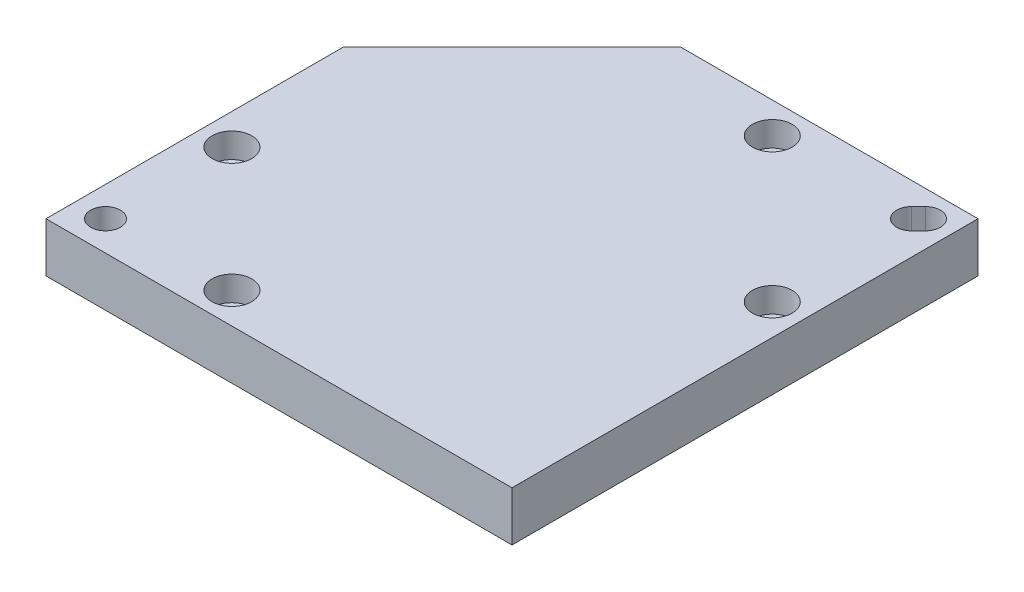
ISO-10303-21;
HEADER;
FILE_DESCRIPTION(('STEP AP214'),'2;1');
FILE_NAME('part.step','',(''),(''),'','','');
FILE_SCHEMA(('AUTOMOTIVE_DESIGN { 1 0 10303 214 1 1 1 1 }'));
ENDSEC;
DATA;
#1=APPLICATION_CONTEXT('core data for automotive mechanical design processes');
#2=APPLICATION_PROTOCOL_DEFINITION('international standard','automotive_design',2000,#1);
#3=PRODUCT_CONTEXT('',#1,'mechanical');
#4=PRODUCT('Part','Part','',(#3));
#5=PRODUCT_RELATED_PRODUCT_CATEGORY('part','',(#4));
#6=PRODUCT_DEFINITION_FORMATION('','',#4);
#7=PRODUCT_DEFINITION_CONTEXT('part definition',#1,'design');
#8=PRODUCT_DEFINITION('design','',#6,#7);
#9=PRODUCT_DEFINITION_SHAPE('','',#8);
#10=(LENGTH_UNIT() NAMED_UNIT(*) SI_UNIT(.MILLI.,.METRE.));
#11=(NAMED_UNIT(*) PLANE_ANGLE_UNIT() SI_UNIT($,.RADIAN.));
#12=(NAMED_UNIT(*) SI_UNIT($,.STERADIAN.) SOLID_ANGLE_UNIT());
#13=UNCERTAINTY_MEASURE_WITH_UNIT(LENGTH_MEASURE(1.E-05),#10,'distance_accuracy_value','');
#14=(GEOMETRIC_REPRESENTATION_CONTEXT(3) GLOBAL_UNCERTAINTY_ASSIGNED_CONTEXT((#13)) GLOBAL_UNIT_ASSIGNED_CONTEXT((#10,
#11,#12)) REPRESENTATION_CONTEXT('',''));
#15=CARTESIAN_POINT('',(0.,0.,0.));
#16=DIRECTION('',(0.,0.,1.));
#17=DIRECTION('',(1.,0.,0.));
#18=AXIS2_PLACEMENT_3D('',#15,#16,#17);
#19=CARTESIAN_POINT('',(58.75,0.,6.25000000000001));
#20=DIRECTION('',(0.,1.,0.));
#21=DIRECTION('',(0.,0.,1.));
#22=AXIS2_PLACEMENT_3D('',#19,#20,#21);
#23=CYLINDRICAL_SURFACE('',#22,2.25);
#24=CARTESIAN_POINT('',(58.75,0.,6.25000000000001));
#25=DIRECTION('',(0.,1.,0.));
#26=DIRECTION('',(0.,0.,1.));
#27=AXIS2_PLACEMENT_3D('',#24,#25,#26);
#28=CIRCLE('',#27,2.25);
#29=CARTESIAN_POINT('',(58.75,0.,8.5));
#30=VERTEX_POINT('',#29);
#31=EDGE_CURVE('E147',#30,#30,#28,.T.);
#32=ORIENTED_EDGE('',*,*,#31,.F.);
#33=EDGE_LOOP('',(#32));
#34=FACE_BOUND('',#33,.T.);
#35=CARTESIAN_POINT('',(58.75,5.,6.25000000000001));
#36=DIRECTION('',(0.,1.,0.));
#37=DIRECTION('',(0.,0.,1.));
#38=AXIS2_PLACEMENT_3D('',#35,#36,#37);
#39=CIRCLE('',#38,2.25);
#40=CARTESIAN_POINT('',(58.75,5.,8.5));
#41=VERTEX_POINT('',#40);
#42=EDGE_CURVE('E41',#41,#41,#39,.F.);
#43=ORIENTED_EDGE('',*,*,#42,.F.);
#44=EDGE_LOOP('',(#43));
#45=FACE_BOUND('',#44,.T.);
#46=ADVANCED_FACE('F37',(#34,#45),#23,.F.);
#47=CARTESIAN_POINT('',(87.75,0.,35.25));
#48=DIRECTION('',(0.,1.,0.));
#49=DIRECTION('',(0.,0.,1.));
#50=AXIS2_PLACEMENT_3D('',#47,#48,#49);
#51=CYLINDRICAL_SURFACE('',#50,2.25);
#52=CARTESIAN_POINT('',(87.75,0.,35.25));
#53=DIRECTION('',(0.,1.,0.));
#54=DIRECTION('',(0.,0.,1.));
#55=AXIS2_PLACEMENT_3D('',#52,#53,#54);
#56=CIRCLE('',#55,2.25);
#57=CARTESIAN_POINT('',(87.75,0.,37.5));
#58=VERTEX_POINT('',#57);
#59=EDGE_CURVE('E151',#58,#58,#56,.T.);
#60=ORIENTED_EDGE('',*,*,#59,.F.);
#61=EDGE_LOOP('',(#60));
#62=FACE_BOUND('',#61,.T.);
#63=CARTESIAN_POINT('',(87.75,5.,35.25));
#64=DIRECTION('',(0.,1.,0.));
#65=DIRECTION('',(0.,0.,1.));
#66=AXIS2_PLACEMENT_3D('',#63,#64,#65);
#67=CIRCLE('',#66,2.25);
#68=CARTESIAN_POINT('',(87.75,5.,37.5));
#69=VERTEX_POINT('',#68);
#70=EDGE_CURVE('E190',#69,#69,#67,.F.);
#71=ORIENTED_EDGE('',*,*,#70,.F.);
#72=EDGE_LOOP('',(#71));
#73=FACE_BOUND('',#72,.T.);
#74=ADVANCED_FACE('F200',(#62,#73),#51,.F.);
#75=CARTESIAN_POINT('',(6.25,0.,62.75));
#76=DIRECTION('',(0.,1.,0.));
#77=DIRECTION('',(0.,0.,1.));
#78=AXIS2_PLACEMENT_3D('',#75,#76,#77);
#79=CYLINDRICAL_SURFACE('',#78,2.25);
#80=CARTESIAN_POINT('',(6.25,0.,62.75));
#81=DIRECTION('',(0.,1.,0.));
#82=DIRECTION('',(0.,0.,1.));
#83=AXIS2_PLACEMENT_3D('',#80,#81,#82);
#84=CIRCLE('',#83,2.25);
#85=CARTESIAN_POINT('',(6.25,0.,65.));
#86=VERTEX_POINT('',#85);
#87=EDGE_CURVE('E292',#86,#86,#84,.T.);
#88=ORIENTED_EDGE('',*,*,#87,.F.);
#89=EDGE_LOOP('',(#88));
#90=FACE_BOUND('',#89,.T.);
#91=CARTESIAN_POINT('',(6.25,5.,62.75));
#92=DIRECTION('',(0.,1.,0.));
#93=DIRECTION('',(0.,0.,1.));
#94=AXIS2_PLACEMENT_3D('',#91,#92,#93);
#95=CIRCLE('',#94,2.25);
#96=CARTESIAN_POINT('',(6.25,5.,65.));
#97=VERTEX_POINT('',#96);
#98=EDGE_CURVE('E187',#97,#97,#95,.F.);
#99=ORIENTED_EDGE('',*,*,#98,.F.);
#100=EDGE_LOOP('',(#99));
#101=FACE_BOUND('',#100,.T.);
#102=ADVANCED_FACE('F206',(#90,#101),#79,.F.);
#103=CARTESIAN_POINT('',(31.25,0.,87.75));
#104=DIRECTION('',(0.,1.,0.));
#105=DIRECTION('',(0.,0.,1.));
#106=AXIS2_PLACEMENT_3D('',#103,#104,#105);
#107=CYLINDRICAL_SURFACE('',#106,2.25);
#108=CARTESIAN_POINT('',(31.25,0.,87.75));
#109=DIRECTION('',(0.,1.,0.));
#110=DIRECTION('',(0.,0.,1.));
#111=AXIS2_PLACEMENT_3D('',#108,#109,#110);
#112=CIRCLE('',#111,2.25);
#113=CARTESIAN_POINT('',(31.25,0.,90.));
#114=VERTEX_POINT('',#113);
#115=EDGE_CURVE('E289',#114,#114,#112,.T.);
#116=ORIENTED_EDGE('',*,*,#115,.F.);
#117=EDGE_LOOP('',(#116));
#118=FACE_BOUND('',#117,.T.);
#119=CARTESIAN_POINT('',(31.25,5.,87.75));
#120=DIRECTION('',(0.,1.,0.));
#121=DIRECTION('',(0.,0.,1.));
#122=AXIS2_PLACEMENT_3D('',#119,#120,#121);
#123=CIRCLE('',#122,2.25);
#124=CARTESIAN_POINT('',(31.25,5.,90.));
#125=VERTEX_POINT('',#124);
#126=EDGE_CURVE('E184',#125,#125,#123,.F.);
#127=ORIENTED_EDGE('',*,*,#126,.F.);
#128=EDGE_LOOP('',(#127));
#129=FACE_BOUND('',#128,.T.);
#130=ADVANCED_FACE('F238',(#118,#129),#107,.F.);
#131=CARTESIAN_POINT('',(94.,10.,0.));
#132=DIRECTION('',(-1.,0.,0.));
#133=DIRECTION('',(0.,0.,1.));
#134=AXIS2_PLACEMENT_3D('',#131,#132,#133);
#135=PLANE('',#134);
#136=DIRECTION('',(0.,0.,-1.));
#137=VECTOR('',#136,1.);
#138=CARTESIAN_POINT('',(94.,0.,0.));
#139=LINE('',#138,#137);
#140=CARTESIAN_POINT('',(94.,0.,94.));
#141=VERTEX_POINT('',#140);
#142=CARTESIAN_POINT('',(94.,0.,0.));
#143=VERTEX_POINT('',#142);
#144=EDGE_CURVE('E150',#141,#143,#139,.T.);
#145=ORIENTED_EDGE('',*,*,#144,.T.);
#146=DIRECTION('',(0.,-1.,0.));
#147=VECTOR('',#146,1.);
#148=CARTESIAN_POINT('',(94.,10.,0.));
#149=LINE('',#148,#147);
#150=CARTESIAN_POINT('',(94.,10.,0.));
#151=VERTEX_POINT('',#150);
#152=EDGE_CURVE('E11',#151,#143,#149,.T.);
#153=ORIENTED_EDGE('',*,*,#152,.F.);
#154=DIRECTION('',(0.,0.,-1.));
#155=VECTOR('',#154,1.);
#156=CARTESIAN_POINT('',(94.,10.,0.));
#157=LINE('',#156,#155);
#158=CARTESIAN_POINT('',(94.,10.,94.));
#159=VERTEX_POINT('',#158);
#160=EDGE_CURVE('E152',#159,#151,#157,.T.);
#161=ORIENTED_EDGE('',*,*,#160,.F.);
#162=DIRECTION('',(0.,-1.,0.));
#163=VECTOR('',#162,1.);
#164=CARTESIAN_POINT('',(94.,10.,94.));
#165=LINE('',#164,#163);
#166=EDGE_CURVE('E164',#159,#141,#165,.T.);
#167=ORIENTED_EDGE('',*,*,#166,.T.);
#168=EDGE_LOOP('',(#145,#153,#161,#167));
#169=FACE_BOUND('',#168,.T.);
#170=ADVANCED_FACE('F39',(#169),#135,.F.);
#171=CARTESIAN_POINT('',(34.,10.,0.));
#172=DIRECTION('',(0.,0.,1.));
#173=DIRECTION('',(1.,0.,0.));
#174=AXIS2_PLACEMENT_3D('',#171,#172,#173);
#175=PLANE('',#174);
#176=DIRECTION('',(-1.,0.,0.));
#177=VECTOR('',#176,1.);
#178=CARTESIAN_POINT('',(34.,0.,0.));
#179=LINE('',#178,#177);
#180=CARTESIAN_POINT('',(34.,0.,0.));
#181=VERTEX_POINT('',#180);
#182=EDGE_CURVE('E167',#143,#181,#179,.T.);
#183=ORIENTED_EDGE('',*,*,#182,.T.);
#184=DIRECTION('',(0.,-1.,0.));
#185=VECTOR('',#184,1.);
#186=CARTESIAN_POINT('',(34.,10.,0.));
#187=LINE('',#186,#185);
#188=CARTESIAN_POINT('',(34.,10.,0.));
#189=VERTEX_POINT('',#188);
#190=EDGE_CURVE('E46',#189,#181,#187,.T.);
#191=ORIENTED_EDGE('',*,*,#190,.F.);
#192=DIRECTION('',(-1.,0.,0.));
#193=VECTOR('',#192,1.);
#194=CARTESIAN_POINT('',(34.,10.,0.));
#195=LINE('',#194,#193);
#196=EDGE_CURVE('E155',#151,#189,#195,.T.);
#197=ORIENTED_EDGE('',*,*,#196,.F.);
#198=ORIENTED_EDGE('',*,*,#152,.T.);
#199=EDGE_LOOP('',(#183,#191,#197,#198));
#200=FACE_BOUND('',#199,.T.);
#201=ADVANCED_FACE('F231',(#200),#175,.F.);
#202=CARTESIAN_POINT('',(0.,10.,34.));
#203=DIRECTION('',(0.707106781186548,0.,0.707106781186547));
#204=DIRECTION('',(0.707106781186547,0.,-0.707106781186548));
#205=AXIS2_PLACEMENT_3D('',#202,#203,#204);
#206=PLANE('',#205);
#207=DIRECTION('',(-0.707106781186547,0.,0.707106781186548));
#208=VECTOR('',#207,1.);
#209=CARTESIAN_POINT('',(0.,0.,34.));
#210=LINE('',#209,#208);
#211=CARTESIAN_POINT('',(0.,0.,34.));
#212=VERTEX_POINT('',#211);
#213=EDGE_CURVE('E169',#181,#212,#210,.T.);
#214=ORIENTED_EDGE('',*,*,#213,.T.);
#215=DIRECTION('',(0.,-1.,0.));
#216=VECTOR('',#215,1.);
#217=CARTESIAN_POINT('',(0.,10.,34.));
#218=LINE('',#217,#216);
#219=CARTESIAN_POINT('',(0.,10.,34.));
#220=VERTEX_POINT('',#219);
#221=EDGE_CURVE('E179',#220,#212,#218,.T.);
#222=ORIENTED_EDGE('',*,*,#221,.F.);
#223=DIRECTION('',(-0.707106781186547,0.,0.707106781186548));
#224=VECTOR('',#223,1.);
#225=CARTESIAN_POINT('',(0.,10.,34.));
#226=LINE('',#225,#224);
#227=EDGE_CURVE('E158',#189,#220,#226,.T.);
#228=ORIENTED_EDGE('',*,*,#227,.F.);
#229=ORIENTED_EDGE('',*,*,#190,.T.);
#230=EDGE_LOOP('',(#214,#222,#228,#229));
#231=FACE_BOUND('',#230,.T.);
#232=ADVANCED_FACE('F228',(#231),#206,.F.);
#233=CARTESIAN_POINT('',(0.,10.,34.));
#234=DIRECTION('',(1.,0.,0.));
#235=DIRECTION('',(0.,0.,-1.));
#236=AXIS2_PLACEMENT_3D('',#233,#234,#235);
#237=PLANE('',#236);
#238=DIRECTION('',(0.,0.,1.));
#239=VECTOR('',#238,1.);
#240=CARTESIAN_POINT('',(0.,0.,34.));
#241=LINE('',#240,#239);
#242=CARTESIAN_POINT('',(0.,0.,94.));
#243=VERTEX_POINT('',#242);
#244=EDGE_CURVE('E171',#212,#243,#241,.T.);
#245=ORIENTED_EDGE('',*,*,#244,.T.);
#246=DIRECTION('',(0.,-1.,0.));
#247=VECTOR('',#246,1.);
#248=CARTESIAN_POINT('',(0.,10.,94.));
#249=LINE('',#248,#247);
#250=CARTESIAN_POINT('',(0.,10.,94.));
#251=VERTEX_POINT('',#250);
#252=EDGE_CURVE('E176',#251,#243,#249,.T.);
#253=ORIENTED_EDGE('',*,*,#252,.F.);
#254=DIRECTION('',(0.,0.,1.));
#255=VECTOR('',#254,1.);
#256=CARTESIAN_POINT('',(0.,10.,34.));
#257=LINE('',#256,#255);
#258=EDGE_CURVE('E160',#220,#251,#257,.T.);
#259=ORIENTED_EDGE('',*,*,#258,.F.);
#260=ORIENTED_EDGE('',*,*,#221,.T.);
#261=EDGE_LOOP('',(#245,#253,#259,#260));
#262=FACE_BOUND('',#261,.T.);
#263=ADVANCED_FACE('F224',(#262),#237,.F.);
#264=CARTESIAN_POINT('',(0.,10.,94.));
#265=DIRECTION('',(0.,0.,-1.));
#266=DIRECTION('',(-1.,0.,0.));
#267=AXIS2_PLACEMENT_3D('',#264,#265,#266);
#268=PLANE('',#267);
#269=DIRECTION('',(1.,0.,0.));
#270=VECTOR('',#269,1.);
#271=CARTESIAN_POINT('',(0.,0.,94.));
#272=LINE('',#271,#270);
#273=EDGE_CURVE('E156',#243,#141,#272,.T.);
#274=ORIENTED_EDGE('',*,*,#273,.T.);
#275=ORIENTED_EDGE('',*,*,#166,.F.);
#276=DIRECTION('',(1.,0.,0.));
#277=VECTOR('',#276,1.);
#278=CARTESIAN_POINT('',(0.,10.,94.));
#279=LINE('',#278,#277);
#280=EDGE_CURVE('E162',#251,#159,#279,.T.);
#281=ORIENTED_EDGE('',*,*,#280,.F.);
#282=ORIENTED_EDGE('',*,*,#252,.T.);
#283=EDGE_LOOP('',(#274,#275,#281,#282));
#284=FACE_BOUND('',#283,.T.);
#285=ADVANCED_FACE('F216',(#284),#268,.F.);
#286=CARTESIAN_POINT('',(0.,10.,0.));
#287=DIRECTION('',(0.,1.,0.));
#288=DIRECTION('',(0.,0.,1.));
#289=AXIS2_PLACEMENT_3D('',#286,#287,#288);
#290=PLANE('',#289);
#291=CARTESIAN_POINT('',(58.75,10.,6.25000000000001));
#292=DIRECTION('',(0.,1.,0.));
#293=DIRECTION('',(0.,0.,1.));
#294=AXIS2_PLACEMENT_3D('',#291,#292,#293);
#295=CIRCLE('',#294,4.);
#296=CARTESIAN_POINT('',(58.75,10.,10.25));
#297=VERTEX_POINT('',#296);
#298=EDGE_CURVE('E315',#297,#297,#295,.T.);
#299=ORIENTED_EDGE('',*,*,#298,.F.);
#300=EDGE_LOOP('',(#299));
#301=FACE_BOUND('',#300,.T.);
#302=CARTESIAN_POINT('',(87.75,10.,35.25));
#303=DIRECTION('',(0.,1.,0.));
#304=DIRECTION('',(0.,0.,1.));
#305=AXIS2_PLACEMENT_3D('',#302,#303,#304);
#306=CIRCLE('',#305,4.00000000000001);
#307=CARTESIAN_POINT('',(87.75,10.,39.25));
#308=VERTEX_POINT('',#307);
#309=EDGE_CURVE('E312',#308,#308,#306,.T.);
#310=ORIENTED_EDGE('',*,*,#309,.F.);
#311=EDGE_LOOP('',(#310));
#312=FACE_BOUND('',#311,.T.);
#313=CARTESIAN_POINT('',(6.25,10.,62.75));
#314=DIRECTION('',(0.,1.,0.));
#315=DIRECTION('',(0.,0.,1.));
#316=AXIS2_PLACEMENT_3D('',#313,#314,#315);
#317=CIRCLE('',#316,4.);
#318=CARTESIAN_POINT('',(6.25,10.,66.75));
#319=VERTEX_POINT('',#318);
#320=EDGE_CURVE('E306',#319,#319,#317,.T.);
#321=ORIENTED_EDGE('',*,*,#320,.F.);
#322=EDGE_LOOP('',(#321));
#323=FACE_BOUND('',#322,.T.);
#324=CARTESIAN_POINT('',(31.25,10.,87.75));
#325=DIRECTION('',(0.,1.,0.));
#326=DIRECTION('',(0.,0.,1.));
#327=AXIS2_PLACEMENT_3D('',#324,#325,#326);
#328=CIRCLE('',#327,4.);
#329=CARTESIAN_POINT('',(31.25,10.,91.75));
#330=VERTEX_POINT('',#329);
#331=EDGE_CURVE('E300',#330,#330,#328,.T.);
#332=ORIENTED_EDGE('',*,*,#331,.F.);
#333=EDGE_LOOP('',(#332));
#334=FACE_BOUND('',#333,.T.);
#335=CARTESIAN_POINT('',(88.7071067811866,10.,5.29289321881346));
#336=DIRECTION('',(0.,1.,0.));
#337=DIRECTION('',(0.,0.,1.));
#338=AXIS2_PLACEMENT_3D('',#335,#336,#337);
#339=CIRCLE('',#338,3.);
#340=CARTESIAN_POINT('',(90.8284271247462,10.,7.41421356237309));
#341=VERTEX_POINT('',#340);
#342=CARTESIAN_POINT('',(86.5857864376269,10.,3.17157287525381));
#343=VERTEX_POINT('',#342);
#344=EDGE_CURVE('E54',#341,#343,#339,.T.);
#345=ORIENTED_EDGE('',*,*,#344,.F.);
#346=DIRECTION('',(0.707106781186547,0.,-0.707106781186547));
#347=VECTOR('',#346,1.);
#348=CARTESIAN_POINT('',(90.8284271247462,10.,7.41421356237309));
#349=LINE('',#348,#347);
#350=CARTESIAN_POINT('',(89.4142135623731,10.,8.82842712474618));
#351=VERTEX_POINT('',#350);
#352=EDGE_CURVE('E119',#351,#341,#349,.T.);
#353=ORIENTED_EDGE('',*,*,#352,.F.);
#354=CARTESIAN_POINT('',(87.2928932188135,10.,6.70710678118655));
#355=DIRECTION('',(0.,1.,0.));
#356=DIRECTION('',(0.,0.,1.));
#357=AXIS2_PLACEMENT_3D('',#354,#355,#356);
#358=CIRCLE('',#357,2.99999999999999);
#359=CARTESIAN_POINT('',(85.1715728752538,10.,4.58578643762691));
#360=VERTEX_POINT('',#359);
#361=EDGE_CURVE('E124',#360,#351,#358,.T.);
#362=ORIENTED_EDGE('',*,*,#361,.F.);
#363=DIRECTION('',(-0.707106781186546,0.,0.707106781186549));
#364=VECTOR('',#363,1.);
#365=CARTESIAN_POINT('',(86.5857864376269,10.,3.17157287525381));
#366=LINE('',#365,#364);
#367=EDGE_CURVE('E130',#343,#360,#366,.T.);
#368=ORIENTED_EDGE('',*,*,#367,.F.);
#369=EDGE_LOOP('',(#345,#353,#362,#368));
#370=FACE_BOUND('',#369,.T.);
#371=CARTESIAN_POINT('',(6.00000000000001,10.,88.));
#372=DIRECTION('',(0.,1.,0.));
#373=DIRECTION('',(0.,0.,1.));
#374=AXIS2_PLACEMENT_3D('',#371,#372,#373);
#375=CIRCLE('',#374,3.00000000000001);
#376=CARTESIAN_POINT('',(6.00000000000001,10.,91.));
#377=VERTEX_POINT('',#376);
#378=EDGE_CURVE('E134',#377,#377,#375,.T.);
#379=ORIENTED_EDGE('',*,*,#378,.F.);
#380=EDGE_LOOP('',(#379));
#381=FACE_BOUND('',#380,.T.);
#382=ORIENTED_EDGE('',*,*,#160,.T.);
#383=ORIENTED_EDGE('',*,*,#196,.T.);
#384=ORIENTED_EDGE('',*,*,#227,.T.);
#385=ORIENTED_EDGE('',*,*,#258,.T.);
#386=ORIENTED_EDGE('',*,*,#280,.T.);
#387=EDGE_LOOP('',(#382,#383,#384,#385,#386));
#388=FACE_BOUND('',#387,.T.);
#389=ADVANCED_FACE('F127',(#301,#312,#323,#334,#370,#381,#388),#290,.T.);
#390=CARTESIAN_POINT('',(0.,0.,0.));
#391=DIRECTION('',(0.,1.,0.));
#392=DIRECTION('',(0.,0.,1.));
#393=AXIS2_PLACEMENT_3D('',#390,#391,#392);
#394=PLANE('',#393);
#395=DIRECTION('',(0.707106781186547,0.,-0.707106781186547));
#396=VECTOR('',#395,1.);
#397=CARTESIAN_POINT('',(90.8284271247462,0.,7.41421356237309));
#398=LINE('',#397,#396);
#399=CARTESIAN_POINT('',(89.4142135623731,0.,8.82842712474618));
#400=VERTEX_POINT('',#399);
#401=CARTESIAN_POINT('',(90.8284271247462,0.,7.41421356237309));
#402=VERTEX_POINT('',#401);
#403=EDGE_CURVE('E139',#400,#402,#398,.T.);
#404=ORIENTED_EDGE('',*,*,#403,.T.);
#405=CARTESIAN_POINT('',(88.7071067811866,0.,5.29289321881346));
#406=DIRECTION('',(0.,1.,0.));
#407=DIRECTION('',(0.,0.,1.));
#408=AXIS2_PLACEMENT_3D('',#405,#406,#407);
#409=CIRCLE('',#408,3.);
#410=CARTESIAN_POINT('',(86.5857864376269,0.,3.17157287525381));
#411=VERTEX_POINT('',#410);
#412=EDGE_CURVE('E112',#402,#411,#409,.T.);
#413=ORIENTED_EDGE('',*,*,#412,.T.);
#414=DIRECTION('',(-0.707106781186546,0.,0.707106781186549));
#415=VECTOR('',#414,1.);
#416=CARTESIAN_POINT('',(86.5857864376269,0.,3.17157287525381));
#417=LINE('',#416,#415);
#418=CARTESIAN_POINT('',(85.1715728752538,0.,4.58578643762691));
#419=VERTEX_POINT('',#418);
#420=EDGE_CURVE('E143',#411,#419,#417,.T.);
#421=ORIENTED_EDGE('',*,*,#420,.T.);
#422=CARTESIAN_POINT('',(87.2928932188135,0.,6.70710678118655));
#423=DIRECTION('',(0.,1.,0.));
#424=DIRECTION('',(0.,0.,1.));
#425=AXIS2_PLACEMENT_3D('',#422,#423,#424);
#426=CIRCLE('',#425,2.99999999999999);
#427=EDGE_CURVE('E62',#419,#400,#426,.T.);
#428=ORIENTED_EDGE('',*,*,#427,.T.);
#429=EDGE_LOOP('',(#404,#413,#421,#428));
#430=FACE_BOUND('',#429,.T.);
#431=CARTESIAN_POINT('',(6.00000000000001,0.,88.));
#432=DIRECTION('',(0.,1.,0.));
#433=DIRECTION('',(0.,0.,1.));
#434=AXIS2_PLACEMENT_3D('',#431,#432,#433);
#435=CIRCLE('',#434,3.00000000000001);
#436=CARTESIAN_POINT('',(6.00000000000001,0.,91.));
#437=VERTEX_POINT('',#436);
#438=EDGE_CURVE('E131',#437,#437,#435,.T.);
#439=ORIENTED_EDGE('',*,*,#438,.T.);
#440=EDGE_LOOP('',(#439));
#441=FACE_BOUND('',#440,.T.);
#442=ORIENTED_EDGE('',*,*,#115,.T.);
#443=EDGE_LOOP('',(#442));
#444=FACE_BOUND('',#443,.T.);
#445=ORIENTED_EDGE('',*,*,#87,.T.);
#446=EDGE_LOOP('',(#445));
#447=FACE_BOUND('',#446,.T.);
#448=ORIENTED_EDGE('',*,*,#59,.T.);
#449=EDGE_LOOP('',(#448));
#450=FACE_BOUND('',#449,.T.);
#451=ORIENTED_EDGE('',*,*,#31,.T.);
#452=EDGE_LOOP('',(#451));
#453=FACE_BOUND('',#452,.T.);
#454=ORIENTED_EDGE('',*,*,#144,.F.);
#455=ORIENTED_EDGE('',*,*,#273,.F.);
#456=ORIENTED_EDGE('',*,*,#244,.F.);
#457=ORIENTED_EDGE('',*,*,#213,.F.);
#458=ORIENTED_EDGE('',*,*,#182,.F.);
#459=EDGE_LOOP('',(#454,#455,#456,#457,#458));
#460=FACE_BOUND('',#459,.T.);
#461=ADVANCED_FACE('F215',(#430,#441,#444,#447,#450,#453,#460),#394,.F.);
#462=CARTESIAN_POINT('',(6.00000000000001,0.,88.));
#463=DIRECTION('',(0.,1.,0.));
#464=DIRECTION('',(0.,0.,1.));
#465=AXIS2_PLACEMENT_3D('',#462,#463,#464);
#466=CYLINDRICAL_SURFACE('',#465,3.00000000000001);
#467=ORIENTED_EDGE('',*,*,#438,.F.);
#468=EDGE_LOOP('',(#467));
#469=FACE_BOUND('',#468,.T.);
#470=ORIENTED_EDGE('',*,*,#378,.T.);
#471=EDGE_LOOP('',(#470));
#472=FACE_BOUND('',#471,.T.);
#473=ADVANCED_FACE('F220',(#469,#472),#466,.F.);
#474=CARTESIAN_POINT('',(88.7071067811866,0.,5.29289321881346));
#475=DIRECTION('',(0.,1.,0.));
#476=DIRECTION('',(0.,0.,1.));
#477=AXIS2_PLACEMENT_3D('',#474,#475,#476);
#478=CYLINDRICAL_SURFACE('',#477,3.);
#479=ORIENTED_EDGE('',*,*,#344,.T.);
#480=DIRECTION('',(0.,1.,0.));
#481=VECTOR('',#480,1.);
#482=CARTESIAN_POINT('',(86.5857864376269,0.,3.17157287525381));
#483=LINE('',#482,#481);
#484=EDGE_CURVE('E141',#411,#343,#483,.T.);
#485=ORIENTED_EDGE('',*,*,#484,.F.);
#486=ORIENTED_EDGE('',*,*,#412,.F.);
#487=DIRECTION('',(0.,1.,0.));
#488=VECTOR('',#487,1.);
#489=CARTESIAN_POINT('',(90.8284271247462,0.,7.41421356237309));
#490=LINE('',#489,#488);
#491=EDGE_CURVE('E108',#402,#341,#490,.T.);
#492=ORIENTED_EDGE('',*,*,#491,.T.);
#493=EDGE_LOOP('',(#479,#485,#486,#492));
#494=FACE_BOUND('',#493,.T.);
#495=ADVANCED_FACE('F110',(#494),#478,.F.);
#496=CARTESIAN_POINT('',(90.8284271247462,0.,7.41421356237309));
#497=DIRECTION('',(0.707106781186548,0.,0.707106781186548));
#498=DIRECTION('',(0.707106781186548,0.,-0.707106781186548));
#499=AXIS2_PLACEMENT_3D('',#496,#497,#498);
#500=PLANE('',#499);
#501=ORIENTED_EDGE('',*,*,#352,.T.);
#502=ORIENTED_EDGE('',*,*,#491,.F.);
#503=ORIENTED_EDGE('',*,*,#403,.F.);
#504=DIRECTION('',(0.,1.,0.));
#505=VECTOR('',#504,1.);
#506=CARTESIAN_POINT('',(89.4142135623731,0.,8.82842712474618));
#507=LINE('',#506,#505);
#508=EDGE_CURVE('E116',#400,#351,#507,.T.);
#509=ORIENTED_EDGE('',*,*,#508,.T.);
#510=EDGE_LOOP('',(#501,#502,#503,#509));
#511=FACE_BOUND('',#510,.T.);
#512=ADVANCED_FACE('F120',(#511),#500,.F.);
#513=CARTESIAN_POINT('',(87.2928932188135,0.,6.70710678118655));
#514=DIRECTION('',(0.,1.,0.));
#515=DIRECTION('',(0.,0.,1.));
#516=AXIS2_PLACEMENT_3D('',#513,#514,#515);
#517=CYLINDRICAL_SURFACE('',#516,2.99999999999999);
#518=ORIENTED_EDGE('',*,*,#361,.T.);
#519=ORIENTED_EDGE('',*,*,#508,.F.);
#520=ORIENTED_EDGE('',*,*,#427,.F.);
#521=DIRECTION('',(0.,1.,0.));
#522=VECTOR('',#521,1.);
#523=CARTESIAN_POINT('',(85.1715728752538,0.,4.58578643762691));
#524=LINE('',#523,#522);
#525=EDGE_CURVE('E282',#419,#360,#524,.T.);
#526=ORIENTED_EDGE('',*,*,#525,.T.);
#527=EDGE_LOOP('',(#518,#519,#520,#526));
#528=FACE_BOUND('',#527,.T.);
#529=ADVANCED_FACE('F276',(#528),#517,.F.);
#530=CARTESIAN_POINT('',(86.5857864376269,0.,3.17157287525381));
#531=DIRECTION('',(-0.707106781186549,0.,-0.707106781186546));
#532=DIRECTION('',(-0.707106781186546,0.,0.707106781186549));
#533=AXIS2_PLACEMENT_3D('',#530,#531,#532);
#534=PLANE('',#533);
#535=ORIENTED_EDGE('',*,*,#367,.T.);
#536=ORIENTED_EDGE('',*,*,#525,.F.);
#537=ORIENTED_EDGE('',*,*,#420,.F.);
#538=ORIENTED_EDGE('',*,*,#484,.T.);
#539=EDGE_LOOP('',(#535,#536,#537,#538));
#540=FACE_BOUND('',#539,.T.);
#541=ADVANCED_FACE('F273',(#540),#534,.F.);
#542=CARTESIAN_POINT('',(31.25,5.,87.75));
#543=DIRECTION('',(0.,1.,0.));
#544=DIRECTION('',(0.,0.,1.));
#545=AXIS2_PLACEMENT_3D('',#542,#543,#544);
#546=PLANE('',#545);
#547=CARTESIAN_POINT('',(31.25,5.,87.75));
#548=DIRECTION('',(0.,1.,0.));
#549=DIRECTION('',(0.,0.,1.));
#550=AXIS2_PLACEMENT_3D('',#547,#548,#549);
#551=CIRCLE('',#550,4.);
#552=CARTESIAN_POINT('',(31.25,5.,91.75));
#553=VERTEX_POINT('',#552);
#554=EDGE_CURVE('E297',#553,#553,#551,.T.);
#555=ORIENTED_EDGE('',*,*,#554,.T.);
#556=EDGE_LOOP('',(#555));
#557=FACE_BOUND('',#556,.T.);
#558=ORIENTED_EDGE('',*,*,#126,.T.);
#559=EDGE_LOOP('',(#558));
#560=FACE_BOUND('',#559,.T.);
#561=ADVANCED_FACE('F275',(#557,#560),#546,.T.);
#562=CARTESIAN_POINT('',(31.25,5.,87.75));
#563=DIRECTION('',(0.,1.,0.));
#564=DIRECTION('',(0.,0.,1.));
#565=AXIS2_PLACEMENT_3D('',#562,#563,#564);
#566=CYLINDRICAL_SURFACE('',#565,4.);
#567=ORIENTED_EDGE('',*,*,#554,.F.);
#568=EDGE_LOOP('',(#567));
#569=FACE_BOUND('',#568,.T.);
#570=ORIENTED_EDGE('',*,*,#331,.T.);
#571=EDGE_LOOP('',(#570));
#572=FACE_BOUND('',#571,.T.);
#573=ADVANCED_FACE('F334',(#569,#572),#566,.F.);
#574=CARTESIAN_POINT('',(6.25,5.,62.75));
#575=DIRECTION('',(0.,1.,0.));
#576=DIRECTION('',(0.,0.,1.));
#577=AXIS2_PLACEMENT_3D('',#574,#575,#576);
#578=PLANE('',#577);
#579=CARTESIAN_POINT('',(6.25,5.,62.75));
#580=DIRECTION('',(0.,1.,0.));
#581=DIRECTION('',(0.,0.,1.));
#582=AXIS2_PLACEMENT_3D('',#579,#580,#581);
#583=CIRCLE('',#582,4.);
#584=CARTESIAN_POINT('',(6.25,5.,66.75));
#585=VERTEX_POINT('',#584);
#586=EDGE_CURVE('E303',#585,#585,#583,.T.);
#587=ORIENTED_EDGE('',*,*,#586,.T.);
#588=EDGE_LOOP('',(#587));
#589=FACE_BOUND('',#588,.T.);
#590=ORIENTED_EDGE('',*,*,#98,.T.);
#591=EDGE_LOOP('',(#590));
#592=FACE_BOUND('',#591,.T.);
#593=ADVANCED_FACE('F336',(#589,#592),#578,.T.);
#594=CARTESIAN_POINT('',(6.25,5.,62.75));
#595=DIRECTION('',(0.,1.,0.));
#596=DIRECTION('',(0.,0.,1.));
#597=AXIS2_PLACEMENT_3D('',#594,#595,#596);
#598=CYLINDRICAL_SURFACE('',#597,4.);
#599=ORIENTED_EDGE('',*,*,#586,.F.);
#600=EDGE_LOOP('',(#599));
#601=FACE_BOUND('',#600,.T.);
#602=ORIENTED_EDGE('',*,*,#320,.T.);
#603=EDGE_LOOP('',(#602));
#604=FACE_BOUND('',#603,.T.);
#605=ADVANCED_FACE('F343',(#601,#604),#598,.F.);
#606=CARTESIAN_POINT('',(87.75,5.,35.25));
#607=DIRECTION('',(0.,1.,0.));
#608=DIRECTION('',(0.,0.,1.));
#609=AXIS2_PLACEMENT_3D('',#606,#607,#608);
#610=PLANE('',#609);
#611=CARTESIAN_POINT('',(87.75,5.,35.25));
#612=DIRECTION('',(0.,1.,0.));
#613=DIRECTION('',(0.,0.,1.));
#614=AXIS2_PLACEMENT_3D('',#611,#612,#613);
#615=CIRCLE('',#614,4.00000000000001);
#616=CARTESIAN_POINT('',(87.75,5.,39.25));
#617=VERTEX_POINT('',#616);
#618=EDGE_CURVE('E309',#617,#617,#615,.T.);
#619=ORIENTED_EDGE('',*,*,#618,.T.);
#620=EDGE_LOOP('',(#619));
#621=FACE_BOUND('',#620,.T.);
#622=ORIENTED_EDGE('',*,*,#70,.T.);
#623=EDGE_LOOP('',(#622));
#624=FACE_BOUND('',#623,.T.);
#625=ADVANCED_FACE('F352',(#621,#624),#610,.T.);
#626=CARTESIAN_POINT('',(87.75,5.,35.25));
#627=DIRECTION('',(0.,1.,0.));
#628=DIRECTION('',(0.,0.,1.));
#629=AXIS2_PLACEMENT_3D('',#626,#627,#628);
#630=CYLINDRICAL_SURFACE('',#629,4.00000000000001);
#631=ORIENTED_EDGE('',*,*,#618,.F.);
#632=EDGE_LOOP('',(#631));
#633=FACE_BOUND('',#632,.T.);
#634=ORIENTED_EDGE('',*,*,#309,.T.);
#635=EDGE_LOOP('',(#634));
#636=FACE_BOUND('',#635,.T.);
#637=ADVANCED_FACE('F356',(#633,#636),#630,.F.);
#638=CARTESIAN_POINT('',(58.75,5.,6.25000000000001));
#639=DIRECTION('',(0.,1.,0.));
#640=DIRECTION('',(0.,0.,1.));
#641=AXIS2_PLACEMENT_3D('',#638,#639,#640);
#642=PLANE('',#641);
#643=CARTESIAN_POINT('',(58.75,5.,6.25000000000001));
#644=DIRECTION('',(0.,1.,0.));
#645=DIRECTION('',(0.,0.,1.));
#646=AXIS2_PLACEMENT_3D('',#643,#644,#645);
#647=CIRCLE('',#646,4.);
#648=CARTESIAN_POINT('',(58.75,5.,10.25));
#649=VERTEX_POINT('',#648);
#650=EDGE_CURVE('E188',#649,#649,#647,.T.);
#651=ORIENTED_EDGE('',*,*,#650,.T.);
#652=EDGE_LOOP('',(#651));
#653=FACE_BOUND('',#652,.T.);
#654=ORIENTED_EDGE('',*,*,#42,.T.);
#655=EDGE_LOOP('',(#654));
#656=FACE_BOUND('',#655,.T.);
#657=ADVANCED_FACE('F197',(#653,#656),#642,.T.);
#658=CARTESIAN_POINT('',(58.75,5.,6.25000000000001));
#659=DIRECTION('',(0.,1.,0.));
#660=DIRECTION('',(0.,0.,1.));
#661=AXIS2_PLACEMENT_3D('',#658,#659,#660);
#662=CYLINDRICAL_SURFACE('',#661,4.);
#663=ORIENTED_EDGE('',*,*,#650,.F.);
#664=EDGE_LOOP('',(#663));
#665=FACE_BOUND('',#664,.T.);
#666=ORIENTED_EDGE('',*,*,#298,.T.);
#667=EDGE_LOOP('',(#666));
#668=FACE_BOUND('',#667,.T.);
#669=ADVANCED_FACE('F322',(#665,#668),#662,.F.);
#670=CLOSED_SHELL('',(#46,#74,#102,#130,#170,#201,#232,#263,#285,#389,#461,#473,#495,#512,#529,
#541,#561,#573,#593,#605,#625,#637,#657,#669));
#671=MANIFOLD_SOLID_BREP('B2',#670);
#672=ADVANCED_BREP_SHAPE_REPRESENTATION('',(#18,#671),#14);
#673=SHAPE_DEFINITION_REPRESENTATION(#9,#672);
ENDSEC;
END-ISO-10303-21;
